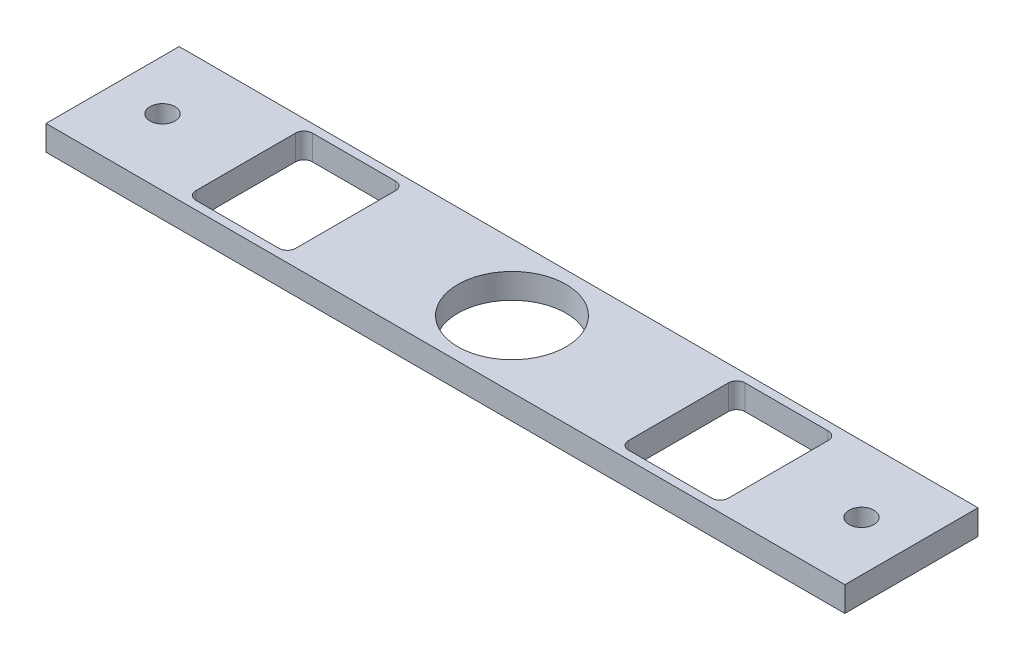
ISO-10303-21;
HEADER;
FILE_DESCRIPTION(('STEP AP214'),'2;1');
FILE_NAME('part.step','',(''),(''),'','','');
FILE_SCHEMA(('AUTOMOTIVE_DESIGN { 1 0 10303 214 1 1 1 1 }'));
ENDSEC;
DATA;
#1=APPLICATION_CONTEXT('core data for automotive mechanical design processes');
#2=APPLICATION_PROTOCOL_DEFINITION('international standard','automotive_design',2000,#1);
#3=PRODUCT_CONTEXT('',#1,'mechanical');
#4=PRODUCT('Part','Part','',(#3));
#5=PRODUCT_RELATED_PRODUCT_CATEGORY('part','',(#4));
#6=PRODUCT_DEFINITION_FORMATION('','',#4);
#7=PRODUCT_DEFINITION_CONTEXT('part definition',#1,'design');
#8=PRODUCT_DEFINITION('design','',#6,#7);
#9=PRODUCT_DEFINITION_SHAPE('','',#8);
#10=(LENGTH_UNIT() NAMED_UNIT(*) SI_UNIT(.MILLI.,.METRE.));
#11=(NAMED_UNIT(*) PLANE_ANGLE_UNIT() SI_UNIT($,.RADIAN.));
#12=(NAMED_UNIT(*) SI_UNIT($,.STERADIAN.) SOLID_ANGLE_UNIT());
#13=UNCERTAINTY_MEASURE_WITH_UNIT(LENGTH_MEASURE(1.E-05),#10,'distance_accuracy_value','');
#14=(GEOMETRIC_REPRESENTATION_CONTEXT(3) GLOBAL_UNCERTAINTY_ASSIGNED_CONTEXT((#13)) GLOBAL_UNIT_ASSIGNED_CONTEXT((#10,
#11,#12)) REPRESENTATION_CONTEXT('',''));
#15=CARTESIAN_POINT('',(0.,0.,0.));
#16=DIRECTION('',(0.,0.,1.));
#17=DIRECTION('',(1.,0.,0.));
#18=AXIS2_PLACEMENT_3D('',#15,#16,#17);
#19=CARTESIAN_POINT('',(152.4,9.525,-25.4));
#20=DIRECTION('',(-1.,0.,0.));
#21=DIRECTION('',(0.,0.,1.));
#22=AXIS2_PLACEMENT_3D('',#19,#20,#21);
#23=PLANE('',#22);
#24=DIRECTION('',(0.,0.,-1.));
#25=VECTOR('',#24,1.);
#26=CARTESIAN_POINT('',(152.4,0.,-25.4));
#27=LINE('',#26,#25);
#28=CARTESIAN_POINT('',(152.4,0.,25.4));
#29=VERTEX_POINT('',#28);
#30=CARTESIAN_POINT('',(152.4,0.,-25.4));
#31=VERTEX_POINT('',#30);
#32=EDGE_CURVE('E202',#29,#31,#27,.T.);
#33=ORIENTED_EDGE('',*,*,#32,.T.);
#34=DIRECTION('',(0.,-1.,0.));
#35=VECTOR('',#34,1.);
#36=CARTESIAN_POINT('',(152.4,9.525,-25.4));
#37=LINE('',#36,#35);
#38=CARTESIAN_POINT('',(152.4,9.525,-25.4));
#39=VERTEX_POINT('',#38);
#40=EDGE_CURVE('E183',#39,#31,#37,.T.);
#41=ORIENTED_EDGE('',*,*,#40,.F.);
#42=DIRECTION('',(0.,0.,-1.));
#43=VECTOR('',#42,1.);
#44=CARTESIAN_POINT('',(152.4,9.525,-25.4));
#45=LINE('',#44,#43);
#46=CARTESIAN_POINT('',(152.4,9.525,25.4));
#47=VERTEX_POINT('',#46);
#48=EDGE_CURVE('E190',#47,#39,#45,.T.);
#49=ORIENTED_EDGE('',*,*,#48,.F.);
#50=DIRECTION('',(0.,-1.,0.));
#51=VECTOR('',#50,1.);
#52=CARTESIAN_POINT('',(152.4,9.525,25.4));
#53=LINE('',#52,#51);
#54=EDGE_CURVE('E327',#47,#29,#53,.T.);
#55=ORIENTED_EDGE('',*,*,#54,.T.);
#56=EDGE_LOOP('',(#33,#41,#49,#55));
#57=FACE_BOUND('',#56,.T.);
#58=ADVANCED_FACE('F41',(#57),#23,.F.);
#59=CARTESIAN_POINT('',(-152.4,9.525,-25.4));
#60=DIRECTION('',(0.,0.,1.));
#61=DIRECTION('',(1.,0.,0.));
#62=AXIS2_PLACEMENT_3D('',#59,#60,#61);
#63=PLANE('',#62);
#64=DIRECTION('',(-1.,0.,0.));
#65=VECTOR('',#64,1.);
#66=CARTESIAN_POINT('',(-152.4,0.,-25.4));
#67=LINE('',#66,#65);
#68=CARTESIAN_POINT('',(-152.4,0.,-25.4));
#69=VERTEX_POINT('',#68);
#70=EDGE_CURVE('E329',#31,#69,#67,.T.);
#71=ORIENTED_EDGE('',*,*,#70,.T.);
#72=DIRECTION('',(0.,-1.,0.));
#73=VECTOR('',#72,1.);
#74=CARTESIAN_POINT('',(-152.4,9.525,-25.4));
#75=LINE('',#74,#73);
#76=CARTESIAN_POINT('',(-152.4,9.525,-25.4));
#77=VERTEX_POINT('',#76);
#78=EDGE_CURVE('E186',#77,#69,#75,.T.);
#79=ORIENTED_EDGE('',*,*,#78,.F.);
#80=DIRECTION('',(-1.,0.,0.));
#81=VECTOR('',#80,1.);
#82=CARTESIAN_POINT('',(-152.4,9.525,-25.4));
#83=LINE('',#82,#81);
#84=EDGE_CURVE('E179',#39,#77,#83,.T.);
#85=ORIENTED_EDGE('',*,*,#84,.F.);
#86=ORIENTED_EDGE('',*,*,#40,.T.);
#87=EDGE_LOOP('',(#71,#79,#85,#86));
#88=FACE_BOUND('',#87,.T.);
#89=ADVANCED_FACE('F181',(#88),#63,.F.);
#90=CARTESIAN_POINT('',(-152.4,9.525,-25.4));
#91=DIRECTION('',(1.,0.,0.));
#92=DIRECTION('',(0.,0.,-1.));
#93=AXIS2_PLACEMENT_3D('',#90,#91,#92);
#94=PLANE('',#93);
#95=DIRECTION('',(0.,0.,1.));
#96=VECTOR('',#95,1.);
#97=CARTESIAN_POINT('',(-152.4,0.,-25.4));
#98=LINE('',#97,#96);
#99=CARTESIAN_POINT('',(-152.4,0.,25.4));
#100=VERTEX_POINT('',#99);
#101=EDGE_CURVE('E331',#69,#100,#98,.T.);
#102=ORIENTED_EDGE('',*,*,#101,.T.);
#103=DIRECTION('',(0.,-1.,0.));
#104=VECTOR('',#103,1.);
#105=CARTESIAN_POINT('',(-152.4,9.525,25.4));
#106=LINE('',#105,#104);
#107=CARTESIAN_POINT('',(-152.4,9.525,25.4));
#108=VERTEX_POINT('',#107);
#109=EDGE_CURVE('E207',#108,#100,#106,.T.);
#110=ORIENTED_EDGE('',*,*,#109,.F.);
#111=DIRECTION('',(0.,0.,1.));
#112=VECTOR('',#111,1.);
#113=CARTESIAN_POINT('',(-152.4,9.525,-25.4));
#114=LINE('',#113,#112);
#115=EDGE_CURVE('E189',#77,#108,#114,.T.);
#116=ORIENTED_EDGE('',*,*,#115,.F.);
#117=ORIENTED_EDGE('',*,*,#78,.T.);
#118=EDGE_LOOP('',(#102,#110,#116,#117));
#119=FACE_BOUND('',#118,.T.);
#120=ADVANCED_FACE('F342',(#119),#94,.F.);
#121=CARTESIAN_POINT('',(-152.4,9.525,25.4));
#122=DIRECTION('',(0.,0.,-1.));
#123=DIRECTION('',(-1.,0.,0.));
#124=AXIS2_PLACEMENT_3D('',#121,#122,#123);
#125=PLANE('',#124);
#126=DIRECTION('',(1.,0.,0.));
#127=VECTOR('',#126,1.);
#128=CARTESIAN_POINT('',(-152.4,0.,25.4));
#129=LINE('',#128,#127);
#130=EDGE_CURVE('E199',#100,#29,#129,.T.);
#131=ORIENTED_EDGE('',*,*,#130,.T.);
#132=ORIENTED_EDGE('',*,*,#54,.F.);
#133=DIRECTION('',(1.,0.,0.));
#134=VECTOR('',#133,1.);
#135=CARTESIAN_POINT('',(-152.4,9.525,25.4));
#136=LINE('',#135,#134);
#137=EDGE_CURVE('E195',#108,#47,#136,.T.);
#138=ORIENTED_EDGE('',*,*,#137,.F.);
#139=ORIENTED_EDGE('',*,*,#109,.T.);
#140=EDGE_LOOP('',(#131,#132,#138,#139));
#141=FACE_BOUND('',#140,.T.);
#142=ADVANCED_FACE('F338',(#141),#125,.F.);
#143=CARTESIAN_POINT('',(0.,9.525,0.));
#144=DIRECTION('',(0.,1.,0.));
#145=DIRECTION('',(0.,0.,1.));
#146=AXIS2_PLACEMENT_3D('',#143,#144,#145);
#147=PLANE('',#146);
#148=CARTESIAN_POINT('',(-133.35,9.525,0.));
#149=DIRECTION('',(0.,1.,0.));
#150=DIRECTION('',(0.,0.,1.));
#151=AXIS2_PLACEMENT_3D('',#148,#149,#150);
#152=CIRCLE('',#151,4.76250000000001);
#153=CARTESIAN_POINT('',(-133.35,9.525,4.76250000000001));
#154=VERTEX_POINT('',#153);
#155=EDGE_CURVE('E423',#154,#154,#152,.T.);
#156=ORIENTED_EDGE('',*,*,#155,.F.);
#157=EDGE_LOOP('',(#156));
#158=FACE_BOUND('',#157,.T.);
#159=DIRECTION('',(0.,0.,-1.));
#160=VECTOR('',#159,1.);
#161=CARTESIAN_POINT('',(101.6,9.525,-22.225));
#162=LINE('',#161,#160);
#163=CARTESIAN_POINT('',(101.6,9.525,19.05));
#164=VERTEX_POINT('',#163);
#165=CARTESIAN_POINT('',(101.6,9.525,-19.05));
#166=VERTEX_POINT('',#165);
#167=EDGE_CURVE('E409',#164,#166,#162,.T.);
#168=ORIENTED_EDGE('',*,*,#167,.F.);
#169=CARTESIAN_POINT('',(98.425,9.525,19.05));
#170=DIRECTION('',(0.,1.,0.));
#171=DIRECTION('',(0.,0.,1.));
#172=AXIS2_PLACEMENT_3D('',#169,#170,#171);
#173=CIRCLE('',#172,3.175);
#174=CARTESIAN_POINT('',(98.425,9.525,22.225));
#175=VERTEX_POINT('',#174);
#176=EDGE_CURVE('E251',#164,#175,#173,.F.);
#177=ORIENTED_EDGE('',*,*,#176,.T.);
#178=DIRECTION('',(1.,0.,0.));
#179=VECTOR('',#178,1.);
#180=CARTESIAN_POINT('',(63.5,9.525,22.225));
#181=LINE('',#180,#179);
#182=CARTESIAN_POINT('',(66.675,9.525,22.225));
#183=VERTEX_POINT('',#182);
#184=EDGE_CURVE('E399',#183,#175,#181,.T.);
#185=ORIENTED_EDGE('',*,*,#184,.F.);
#186=CARTESIAN_POINT('',(66.675,9.525,19.05));
#187=DIRECTION('',(0.,1.,0.));
#188=DIRECTION('',(0.,0.,1.));
#189=AXIS2_PLACEMENT_3D('',#186,#187,#188);
#190=CIRCLE('',#189,3.175);
#191=CARTESIAN_POINT('',(63.5,9.525,19.05));
#192=VERTEX_POINT('',#191);
#193=EDGE_CURVE('E259',#183,#192,#190,.F.);
#194=ORIENTED_EDGE('',*,*,#193,.T.);
#195=DIRECTION('',(0.,0.,1.));
#196=VECTOR('',#195,1.);
#197=CARTESIAN_POINT('',(63.5,9.525,-22.225));
#198=LINE('',#197,#196);
#199=CARTESIAN_POINT('',(63.5,9.525,-19.05));
#200=VERTEX_POINT('',#199);
#201=EDGE_CURVE('E403',#200,#192,#198,.T.);
#202=ORIENTED_EDGE('',*,*,#201,.F.);
#203=CARTESIAN_POINT('',(66.675,9.525,-19.05));
#204=DIRECTION('',(0.,1.,0.));
#205=DIRECTION('',(0.,0.,1.));
#206=AXIS2_PLACEMENT_3D('',#203,#204,#205);
#207=CIRCLE('',#206,3.175);
#208=CARTESIAN_POINT('',(66.675,9.525,-22.225));
#209=VERTEX_POINT('',#208);
#210=EDGE_CURVE('E247',#200,#209,#207,.F.);
#211=ORIENTED_EDGE('',*,*,#210,.T.);
#212=DIRECTION('',(-1.,0.,0.));
#213=VECTOR('',#212,1.);
#214=CARTESIAN_POINT('',(63.5,9.525,-22.225));
#215=LINE('',#214,#213);
#216=CARTESIAN_POINT('',(98.425,9.525,-22.225));
#217=VERTEX_POINT('',#216);
#218=EDGE_CURVE('E406',#217,#209,#215,.T.);
#219=ORIENTED_EDGE('',*,*,#218,.F.);
#220=CARTESIAN_POINT('',(98.425,9.525,-19.05));
#221=DIRECTION('',(0.,1.,0.));
#222=DIRECTION('',(0.,0.,1.));
#223=AXIS2_PLACEMENT_3D('',#220,#221,#222);
#224=CIRCLE('',#223,3.175);
#225=EDGE_CURVE('E255',#217,#166,#224,.F.);
#226=ORIENTED_EDGE('',*,*,#225,.T.);
#227=EDGE_LOOP('',(#168,#177,#185,#194,#202,#211,#219,#226));
#228=FACE_BOUND('',#227,.T.);
#229=DIRECTION('',(0.,0.,-1.));
#230=VECTOR('',#229,1.);
#231=CARTESIAN_POINT('',(-63.5,9.525,-22.225));
#232=LINE('',#231,#230);
#233=CARTESIAN_POINT('',(-63.5,9.525,19.05));
#234=VERTEX_POINT('',#233);
#235=CARTESIAN_POINT('',(-63.5,9.525,-19.05));
#236=VERTEX_POINT('',#235);
#237=EDGE_CURVE('E285',#234,#236,#232,.T.);
#238=ORIENTED_EDGE('',*,*,#237,.F.);
#239=CARTESIAN_POINT('',(-66.675,9.525,19.0500000000001));
#240=DIRECTION('',(0.,1.,0.));
#241=DIRECTION('',(0.,0.,1.));
#242=AXIS2_PLACEMENT_3D('',#239,#240,#241);
#243=CIRCLE('',#242,3.175);
#244=CARTESIAN_POINT('',(-66.675,9.525,22.2250000000001));
#245=VERTEX_POINT('',#244);
#246=EDGE_CURVE('E267',#234,#245,#243,.F.);
#247=ORIENTED_EDGE('',*,*,#246,.T.);
#248=DIRECTION('',(1.,0.,0.));
#249=VECTOR('',#248,1.);
#250=CARTESIAN_POINT('',(-101.6,9.525,22.2250000000001));
#251=LINE('',#250,#249);
#252=CARTESIAN_POINT('',(-98.425,9.525,22.2250000000001));
#253=VERTEX_POINT('',#252);
#254=EDGE_CURVE('E311',#253,#245,#251,.T.);
#255=ORIENTED_EDGE('',*,*,#254,.F.);
#256=CARTESIAN_POINT('',(-98.425,9.525,19.0500000000001));
#257=DIRECTION('',(0.,1.,0.));
#258=DIRECTION('',(0.,0.,1.));
#259=AXIS2_PLACEMENT_3D('',#256,#257,#258);
#260=CIRCLE('',#259,3.175);
#261=CARTESIAN_POINT('',(-101.6,9.525,19.05));
#262=VERTEX_POINT('',#261);
#263=EDGE_CURVE('E263',#253,#262,#260,.F.);
#264=ORIENTED_EDGE('',*,*,#263,.T.);
#265=DIRECTION('',(0.,0.,1.));
#266=VECTOR('',#265,1.);
#267=CARTESIAN_POINT('',(-101.6,9.525,-22.225));
#268=LINE('',#267,#266);
#269=CARTESIAN_POINT('',(-101.6,9.525,-19.05));
#270=VERTEX_POINT('',#269);
#271=EDGE_CURVE('E280',#270,#262,#268,.T.);
#272=ORIENTED_EDGE('',*,*,#271,.F.);
#273=CARTESIAN_POINT('',(-98.425,9.525,-19.05));
#274=DIRECTION('',(0.,1.,0.));
#275=DIRECTION('',(0.,0.,1.));
#276=AXIS2_PLACEMENT_3D('',#273,#274,#275);
#277=CIRCLE('',#276,3.175);
#278=CARTESIAN_POINT('',(-98.425,9.525,-22.225));
#279=VERTEX_POINT('',#278);
#280=EDGE_CURVE('E49',#270,#279,#277,.F.);
#281=ORIENTED_EDGE('',*,*,#280,.T.);
#282=DIRECTION('',(-1.,0.,0.));
#283=VECTOR('',#282,1.);
#284=CARTESIAN_POINT('',(-101.6,9.525,-22.225));
#285=LINE('',#284,#283);
#286=CARTESIAN_POINT('',(-66.675,9.525,-22.225));
#287=VERTEX_POINT('',#286);
#288=EDGE_CURVE('E278',#287,#279,#285,.T.);
#289=ORIENTED_EDGE('',*,*,#288,.F.);
#290=CARTESIAN_POINT('',(-66.675,9.525,-19.05));
#291=DIRECTION('',(0.,1.,0.));
#292=DIRECTION('',(0.,0.,1.));
#293=AXIS2_PLACEMENT_3D('',#290,#291,#292);
#294=CIRCLE('',#293,3.175);
#295=EDGE_CURVE('E271',#287,#236,#294,.F.);
#296=ORIENTED_EDGE('',*,*,#295,.T.);
#297=EDGE_LOOP('',(#238,#247,#255,#264,#272,#281,#289,#296));
#298=FACE_BOUND('',#297,.T.);
#299=CARTESIAN_POINT('',(133.35,9.525,0.));
#300=DIRECTION('',(0.,1.,0.));
#301=DIRECTION('',(0.,0.,1.));
#302=AXIS2_PLACEMENT_3D('',#299,#300,#301);
#303=CIRCLE('',#302,4.76250000000001);
#304=CARTESIAN_POINT('',(133.35,9.525,4.76250000000001));
#305=VERTEX_POINT('',#304);
#306=EDGE_CURVE('E301',#305,#305,#303,.T.);
#307=ORIENTED_EDGE('',*,*,#306,.F.);
#308=EDGE_LOOP('',(#307));
#309=FACE_BOUND('',#308,.T.);
#310=CARTESIAN_POINT('',(0.,9.525,0.));
#311=DIRECTION('',(0.,1.,0.));
#312=DIRECTION('',(0.,0.,1.));
#313=AXIS2_PLACEMENT_3D('',#310,#311,#312);
#314=CIRCLE('',#313,20.6375);
#315=CARTESIAN_POINT('',(0.,9.525,20.6375));
#316=VERTEX_POINT('',#315);
#317=EDGE_CURVE('E317',#316,#316,#314,.T.);
#318=ORIENTED_EDGE('',*,*,#317,.F.);
#319=EDGE_LOOP('',(#318));
#320=FACE_BOUND('',#319,.T.);
#321=ORIENTED_EDGE('',*,*,#48,.T.);
#322=ORIENTED_EDGE('',*,*,#84,.T.);
#323=ORIENTED_EDGE('',*,*,#115,.T.);
#324=ORIENTED_EDGE('',*,*,#137,.T.);
#325=EDGE_LOOP('',(#321,#322,#323,#324));
#326=FACE_BOUND('',#325,.T.);
#327=ADVANCED_FACE('F193',(#158,#228,#298,#309,#320,#326),#147,.T.);
#328=CARTESIAN_POINT('',(0.,0.,0.));
#329=DIRECTION('',(0.,1.,0.));
#330=DIRECTION('',(0.,0.,1.));
#331=AXIS2_PLACEMENT_3D('',#328,#329,#330);
#332=PLANE('',#331);
#333=CARTESIAN_POINT('',(-133.35,0.,0.));
#334=DIRECTION('',(0.,1.,0.));
#335=DIRECTION('',(0.,0.,1.));
#336=AXIS2_PLACEMENT_3D('',#333,#334,#335);
#337=CIRCLE('',#336,4.76250000000001);
#338=CARTESIAN_POINT('',(-133.35,0.,4.76250000000001));
#339=VERTEX_POINT('',#338);
#340=EDGE_CURVE('E412',#339,#339,#337,.T.);
#341=ORIENTED_EDGE('',*,*,#340,.T.);
#342=EDGE_LOOP('',(#341));
#343=FACE_BOUND('',#342,.T.);
#344=DIRECTION('',(0.,0.,1.));
#345=VECTOR('',#344,1.);
#346=CARTESIAN_POINT('',(63.5,0.,-22.225));
#347=LINE('',#346,#345);
#348=CARTESIAN_POINT('',(63.5,0.,-19.05));
#349=VERTEX_POINT('',#348);
#350=CARTESIAN_POINT('',(63.5,0.,19.05));
#351=VERTEX_POINT('',#350);
#352=EDGE_CURVE('E415',#349,#351,#347,.T.);
#353=ORIENTED_EDGE('',*,*,#352,.T.);
#354=CARTESIAN_POINT('',(66.675,0.,19.05));
#355=DIRECTION('',(0.,1.,0.));
#356=DIRECTION('',(0.,0.,1.));
#357=AXIS2_PLACEMENT_3D('',#354,#355,#356);
#358=CIRCLE('',#357,3.175);
#359=CARTESIAN_POINT('',(66.675,0.,22.225));
#360=VERTEX_POINT('',#359);
#361=EDGE_CURVE('E261',#351,#360,#358,.T.);
#362=ORIENTED_EDGE('',*,*,#361,.T.);
#363=DIRECTION('',(1.,0.,0.));
#364=VECTOR('',#363,1.);
#365=CARTESIAN_POINT('',(63.5,0.,22.225));
#366=LINE('',#365,#364);
#367=CARTESIAN_POINT('',(98.425,0.,22.225));
#368=VERTEX_POINT('',#367);
#369=EDGE_CURVE('E308',#360,#368,#366,.T.);
#370=ORIENTED_EDGE('',*,*,#369,.T.);
#371=CARTESIAN_POINT('',(98.425,0.,19.05));
#372=DIRECTION('',(0.,1.,0.));
#373=DIRECTION('',(0.,0.,1.));
#374=AXIS2_PLACEMENT_3D('',#371,#372,#373);
#375=CIRCLE('',#374,3.175);
#376=CARTESIAN_POINT('',(101.6,0.,19.05));
#377=VERTEX_POINT('',#376);
#378=EDGE_CURVE('E253',#368,#377,#375,.T.);
#379=ORIENTED_EDGE('',*,*,#378,.T.);
#380=DIRECTION('',(0.,0.,-1.));
#381=VECTOR('',#380,1.);
#382=CARTESIAN_POINT('',(101.6,0.,-22.225));
#383=LINE('',#382,#381);
#384=CARTESIAN_POINT('',(101.6,0.,-19.05));
#385=VERTEX_POINT('',#384);
#386=EDGE_CURVE('E402',#377,#385,#383,.T.);
#387=ORIENTED_EDGE('',*,*,#386,.T.);
#388=CARTESIAN_POINT('',(98.425,0.,-19.05));
#389=DIRECTION('',(0.,1.,0.));
#390=DIRECTION('',(0.,0.,1.));
#391=AXIS2_PLACEMENT_3D('',#388,#389,#390);
#392=CIRCLE('',#391,3.175);
#393=CARTESIAN_POINT('',(98.425,0.,-22.225));
#394=VERTEX_POINT('',#393);
#395=EDGE_CURVE('E257',#385,#394,#392,.T.);
#396=ORIENTED_EDGE('',*,*,#395,.T.);
#397=DIRECTION('',(-1.,0.,0.));
#398=VECTOR('',#397,1.);
#399=CARTESIAN_POINT('',(63.5,0.,-22.225));
#400=LINE('',#399,#398);
#401=CARTESIAN_POINT('',(66.675,0.,-22.225));
#402=VERTEX_POINT('',#401);
#403=EDGE_CURVE('E418',#394,#402,#400,.T.);
#404=ORIENTED_EDGE('',*,*,#403,.T.);
#405=CARTESIAN_POINT('',(66.675,0.,-19.05));
#406=DIRECTION('',(0.,1.,0.));
#407=DIRECTION('',(0.,0.,1.));
#408=AXIS2_PLACEMENT_3D('',#405,#406,#407);
#409=CIRCLE('',#408,3.175);
#410=EDGE_CURVE('E249',#402,#349,#409,.T.);
#411=ORIENTED_EDGE('',*,*,#410,.T.);
#412=EDGE_LOOP('',(#353,#362,#370,#379,#387,#396,#404,#411));
#413=FACE_BOUND('',#412,.T.);
#414=DIRECTION('',(0.,0.,1.));
#415=VECTOR('',#414,1.);
#416=CARTESIAN_POINT('',(-101.6,0.,-22.225));
#417=LINE('',#416,#415);
#418=CARTESIAN_POINT('',(-101.6,0.,-19.05));
#419=VERTEX_POINT('',#418);
#420=CARTESIAN_POINT('',(-101.6,0.,19.05));
#421=VERTEX_POINT('',#420);
#422=EDGE_CURVE('E292',#419,#421,#417,.T.);
#423=ORIENTED_EDGE('',*,*,#422,.T.);
#424=CARTESIAN_POINT('',(-98.425,0.,19.0500000000001));
#425=DIRECTION('',(0.,1.,0.));
#426=DIRECTION('',(0.,0.,1.));
#427=AXIS2_PLACEMENT_3D('',#424,#425,#426);
#428=CIRCLE('',#427,3.175);
#429=CARTESIAN_POINT('',(-98.425,0.,22.2250000000001));
#430=VERTEX_POINT('',#429);
#431=EDGE_CURVE('E265',#421,#430,#428,.T.);
#432=ORIENTED_EDGE('',*,*,#431,.T.);
#433=DIRECTION('',(1.,0.,0.));
#434=VECTOR('',#433,1.);
#435=CARTESIAN_POINT('',(-101.6,0.,22.2250000000001));
#436=LINE('',#435,#434);
#437=CARTESIAN_POINT('',(-66.675,0.,22.2250000000001));
#438=VERTEX_POINT('',#437);
#439=EDGE_CURVE('E298',#430,#438,#436,.T.);
#440=ORIENTED_EDGE('',*,*,#439,.T.);
#441=CARTESIAN_POINT('',(-66.675,0.,19.0500000000001));
#442=DIRECTION('',(0.,1.,0.));
#443=DIRECTION('',(0.,0.,1.));
#444=AXIS2_PLACEMENT_3D('',#441,#442,#443);
#445=CIRCLE('',#444,3.175);
#446=CARTESIAN_POINT('',(-63.5,0.,19.05));
#447=VERTEX_POINT('',#446);
#448=EDGE_CURVE('E269',#438,#447,#445,.T.);
#449=ORIENTED_EDGE('',*,*,#448,.T.);
#450=DIRECTION('',(0.,0.,-1.));
#451=VECTOR('',#450,1.);
#452=CARTESIAN_POINT('',(-63.5,0.,-22.225));
#453=LINE('',#452,#451);
#454=CARTESIAN_POINT('',(-63.5,0.,-19.05));
#455=VERTEX_POINT('',#454);
#456=EDGE_CURVE('E303',#447,#455,#453,.T.);
#457=ORIENTED_EDGE('',*,*,#456,.T.);
#458=CARTESIAN_POINT('',(-66.675,0.,-19.05));
#459=DIRECTION('',(0.,1.,0.));
#460=DIRECTION('',(0.,0.,1.));
#461=AXIS2_PLACEMENT_3D('',#458,#459,#460);
#462=CIRCLE('',#461,3.175);
#463=CARTESIAN_POINT('',(-66.675,0.,-22.225));
#464=VERTEX_POINT('',#463);
#465=EDGE_CURVE('E63',#455,#464,#462,.T.);
#466=ORIENTED_EDGE('',*,*,#465,.T.);
#467=DIRECTION('',(-1.,0.,0.));
#468=VECTOR('',#467,1.);
#469=CARTESIAN_POINT('',(-101.6,0.,-22.225));
#470=LINE('',#469,#468);
#471=CARTESIAN_POINT('',(-98.425,0.,-22.225));
#472=VERTEX_POINT('',#471);
#473=EDGE_CURVE('E294',#464,#472,#470,.T.);
#474=ORIENTED_EDGE('',*,*,#473,.T.);
#475=CARTESIAN_POINT('',(-98.425,0.,-19.05));
#476=DIRECTION('',(0.,1.,0.));
#477=DIRECTION('',(0.,0.,1.));
#478=AXIS2_PLACEMENT_3D('',#475,#476,#477);
#479=CIRCLE('',#478,3.175);
#480=EDGE_CURVE('E11',#472,#419,#479,.T.);
#481=ORIENTED_EDGE('',*,*,#480,.T.);
#482=EDGE_LOOP('',(#423,#432,#440,#449,#457,#466,#474,#481));
#483=FACE_BOUND('',#482,.T.);
#484=CARTESIAN_POINT('',(133.35,0.,0.));
#485=DIRECTION('',(0.,1.,0.));
#486=DIRECTION('',(0.,0.,1.));
#487=AXIS2_PLACEMENT_3D('',#484,#485,#486);
#488=CIRCLE('',#487,4.76250000000001);
#489=CARTESIAN_POINT('',(133.35,0.,4.76250000000001));
#490=VERTEX_POINT('',#489);
#491=EDGE_CURVE('E314',#490,#490,#488,.T.);
#492=ORIENTED_EDGE('',*,*,#491,.T.);
#493=EDGE_LOOP('',(#492));
#494=FACE_BOUND('',#493,.T.);
#495=CARTESIAN_POINT('',(0.,0.,0.));
#496=DIRECTION('',(0.,1.,0.));
#497=DIRECTION('',(0.,0.,1.));
#498=AXIS2_PLACEMENT_3D('',#495,#496,#497);
#499=CIRCLE('',#498,20.6375);
#500=CARTESIAN_POINT('',(0.,0.,20.6375));
#501=VERTEX_POINT('',#500);
#502=EDGE_CURVE('E320',#501,#501,#499,.T.);
#503=ORIENTED_EDGE('',*,*,#502,.T.);
#504=EDGE_LOOP('',(#503));
#505=FACE_BOUND('',#504,.T.);
#506=ORIENTED_EDGE('',*,*,#32,.F.);
#507=ORIENTED_EDGE('',*,*,#130,.F.);
#508=ORIENTED_EDGE('',*,*,#101,.F.);
#509=ORIENTED_EDGE('',*,*,#70,.F.);
#510=EDGE_LOOP('',(#506,#507,#508,#509));
#511=FACE_BOUND('',#510,.T.);
#512=ADVANCED_FACE('F290',(#343,#413,#483,#494,#505,#511),#332,.F.);
#513=CARTESIAN_POINT('',(0.,0.,0.));
#514=DIRECTION('',(0.,1.,0.));
#515=DIRECTION('',(0.,0.,1.));
#516=AXIS2_PLACEMENT_3D('',#513,#514,#515);
#517=CYLINDRICAL_SURFACE('',#516,20.6375);
#518=ORIENTED_EDGE('',*,*,#502,.F.);
#519=EDGE_LOOP('',(#518));
#520=FACE_BOUND('',#519,.T.);
#521=ORIENTED_EDGE('',*,*,#317,.T.);
#522=EDGE_LOOP('',(#521));
#523=FACE_BOUND('',#522,.T.);
#524=ADVANCED_FACE('F489',(#520,#523),#517,.F.);
#525=CARTESIAN_POINT('',(133.35,0.,0.));
#526=DIRECTION('',(0.,1.,0.));
#527=DIRECTION('',(0.,0.,1.));
#528=AXIS2_PLACEMENT_3D('',#525,#526,#527);
#529=CYLINDRICAL_SURFACE('',#528,4.76250000000001);
#530=ORIENTED_EDGE('',*,*,#491,.F.);
#531=EDGE_LOOP('',(#530));
#532=FACE_BOUND('',#531,.T.);
#533=ORIENTED_EDGE('',*,*,#306,.T.);
#534=EDGE_LOOP('',(#533));
#535=FACE_BOUND('',#534,.T.);
#536=ADVANCED_FACE('F486',(#532,#535),#529,.F.);
#537=CARTESIAN_POINT('',(-63.5,0.,-22.225));
#538=DIRECTION('',(1.,0.,0.));
#539=DIRECTION('',(0.,0.,-1.));
#540=AXIS2_PLACEMENT_3D('',#537,#538,#539);
#541=PLANE('',#540);
#542=ORIENTED_EDGE('',*,*,#456,.F.);
#543=DIRECTION('',(0.,1.,0.));
#544=VECTOR('',#543,1.);
#545=CARTESIAN_POINT('',(-63.5,9.525,19.0500000000001));
#546=LINE('',#545,#544);
#547=EDGE_CURVE('E240',#447,#234,#546,.T.);
#548=ORIENTED_EDGE('',*,*,#547,.T.);
#549=ORIENTED_EDGE('',*,*,#237,.T.);
#550=DIRECTION('',(0.,1.,0.));
#551=VECTOR('',#550,1.);
#552=CARTESIAN_POINT('',(-63.5,0.,-19.05));
#553=LINE('',#552,#551);
#554=EDGE_CURVE('E238',#236,#455,#553,.F.);
#555=ORIENTED_EDGE('',*,*,#554,.T.);
#556=EDGE_LOOP('',(#542,#548,#549,#555));
#557=FACE_BOUND('',#556,.T.);
#558=ADVANCED_FACE('F389',(#557),#541,.F.);
#559=CARTESIAN_POINT('',(-101.6,0.,22.2250000000001));
#560=DIRECTION('',(0.,0.,1.));
#561=DIRECTION('',(1.,0.,0.));
#562=AXIS2_PLACEMENT_3D('',#559,#560,#561);
#563=PLANE('',#562);
#564=ORIENTED_EDGE('',*,*,#439,.F.);
#565=DIRECTION('',(0.,1.,0.));
#566=VECTOR('',#565,1.);
#567=CARTESIAN_POINT('',(-98.425,9.525,22.2250000000001));
#568=LINE('',#567,#566);
#569=EDGE_CURVE('E230',#430,#253,#568,.T.);
#570=ORIENTED_EDGE('',*,*,#569,.T.);
#571=ORIENTED_EDGE('',*,*,#254,.T.);
#572=DIRECTION('',(0.,1.,0.));
#573=VECTOR('',#572,1.);
#574=CARTESIAN_POINT('',(-66.675,0.,22.2250000000001));
#575=LINE('',#574,#573);
#576=EDGE_CURVE('E228',#245,#438,#575,.F.);
#577=ORIENTED_EDGE('',*,*,#576,.T.);
#578=EDGE_LOOP('',(#564,#570,#571,#577));
#579=FACE_BOUND('',#578,.T.);
#580=ADVANCED_FACE('F396',(#579),#563,.F.);
#581=CARTESIAN_POINT('',(-101.6,0.,-22.225));
#582=DIRECTION('',(-1.,0.,0.));
#583=DIRECTION('',(0.,0.,1.));
#584=AXIS2_PLACEMENT_3D('',#581,#582,#583);
#585=PLANE('',#584);
#586=ORIENTED_EDGE('',*,*,#271,.T.);
#587=DIRECTION('',(0.,1.,0.));
#588=VECTOR('',#587,1.);
#589=CARTESIAN_POINT('',(-101.6,0.,19.0500000000001));
#590=LINE('',#589,#588);
#591=EDGE_CURVE('E236',#262,#421,#590,.F.);
#592=ORIENTED_EDGE('',*,*,#591,.T.);
#593=ORIENTED_EDGE('',*,*,#422,.F.);
#594=DIRECTION('',(0.,1.,0.));
#595=VECTOR('',#594,1.);
#596=CARTESIAN_POINT('',(-101.6,9.525,-19.05));
#597=LINE('',#596,#595);
#598=EDGE_CURVE('E233',#419,#270,#597,.T.);
#599=ORIENTED_EDGE('',*,*,#598,.T.);
#600=EDGE_LOOP('',(#586,#592,#593,#599));
#601=FACE_BOUND('',#600,.T.);
#602=ADVANCED_FACE('F296',(#601),#585,.F.);
#603=CARTESIAN_POINT('',(-101.6,0.,-22.225));
#604=DIRECTION('',(0.,0.,-1.));
#605=DIRECTION('',(-1.,0.,0.));
#606=AXIS2_PLACEMENT_3D('',#603,#604,#605);
#607=PLANE('',#606);
#608=ORIENTED_EDGE('',*,*,#473,.F.);
#609=DIRECTION('',(0.,1.,0.));
#610=VECTOR('',#609,1.);
#611=CARTESIAN_POINT('',(-66.675,9.525,-22.225));
#612=LINE('',#611,#610);
#613=EDGE_CURVE('E244',#464,#287,#612,.T.);
#614=ORIENTED_EDGE('',*,*,#613,.T.);
#615=ORIENTED_EDGE('',*,*,#288,.T.);
#616=DIRECTION('',(0.,1.,0.));
#617=VECTOR('',#616,1.);
#618=CARTESIAN_POINT('',(-98.425,0.,-22.225));
#619=LINE('',#618,#617);
#620=EDGE_CURVE('E56',#279,#472,#619,.F.);
#621=ORIENTED_EDGE('',*,*,#620,.T.);
#622=EDGE_LOOP('',(#608,#614,#615,#621));
#623=FACE_BOUND('',#622,.T.);
#624=ADVANCED_FACE('F283',(#623),#607,.F.);
#625=CARTESIAN_POINT('',(101.6,0.,-22.225));
#626=DIRECTION('',(1.,0.,0.));
#627=DIRECTION('',(0.,0.,-1.));
#628=AXIS2_PLACEMENT_3D('',#625,#626,#627);
#629=PLANE('',#628);
#630=ORIENTED_EDGE('',*,*,#386,.F.);
#631=DIRECTION('',(0.,1.,0.));
#632=VECTOR('',#631,1.);
#633=CARTESIAN_POINT('',(101.6,9.525,19.05));
#634=LINE('',#633,#632);
#635=EDGE_CURVE('E220',#377,#164,#634,.T.);
#636=ORIENTED_EDGE('',*,*,#635,.T.);
#637=ORIENTED_EDGE('',*,*,#167,.T.);
#638=DIRECTION('',(0.,1.,0.));
#639=VECTOR('',#638,1.);
#640=CARTESIAN_POINT('',(101.6,0.,-19.05));
#641=LINE('',#640,#639);
#642=EDGE_CURVE('E218',#166,#385,#641,.F.);
#643=ORIENTED_EDGE('',*,*,#642,.T.);
#644=EDGE_LOOP('',(#630,#636,#637,#643));
#645=FACE_BOUND('',#644,.T.);
#646=ADVANCED_FACE('F446',(#645),#629,.F.);
#647=CARTESIAN_POINT('',(63.5,0.,22.225));
#648=DIRECTION('',(0.,0.,1.));
#649=DIRECTION('',(1.,0.,0.));
#650=AXIS2_PLACEMENT_3D('',#647,#648,#649);
#651=PLANE('',#650);
#652=ORIENTED_EDGE('',*,*,#184,.T.);
#653=DIRECTION('',(0.,1.,0.));
#654=VECTOR('',#653,1.);
#655=CARTESIAN_POINT('',(98.425,0.,22.225));
#656=LINE('',#655,#654);
#657=EDGE_CURVE('E226',#175,#368,#656,.F.);
#658=ORIENTED_EDGE('',*,*,#657,.T.);
#659=ORIENTED_EDGE('',*,*,#369,.F.);
#660=DIRECTION('',(0.,1.,0.));
#661=VECTOR('',#660,1.);
#662=CARTESIAN_POINT('',(66.675,9.525,22.225));
#663=LINE('',#662,#661);
#664=EDGE_CURVE('E223',#360,#183,#663,.T.);
#665=ORIENTED_EDGE('',*,*,#664,.T.);
#666=EDGE_LOOP('',(#652,#658,#659,#665));
#667=FACE_BOUND('',#666,.T.);
#668=ADVANCED_FACE('F465',(#667),#651,.F.);
#669=CARTESIAN_POINT('',(63.5,0.,-22.225));
#670=DIRECTION('',(-1.,0.,0.));
#671=DIRECTION('',(0.,0.,1.));
#672=AXIS2_PLACEMENT_3D('',#669,#670,#671);
#673=PLANE('',#672);
#674=ORIENTED_EDGE('',*,*,#352,.F.);
#675=DIRECTION('',(0.,1.,0.));
#676=VECTOR('',#675,1.);
#677=CARTESIAN_POINT('',(63.5,9.525,-19.05));
#678=LINE('',#677,#676);
#679=EDGE_CURVE('E205',#349,#200,#678,.T.);
#680=ORIENTED_EDGE('',*,*,#679,.T.);
#681=ORIENTED_EDGE('',*,*,#201,.T.);
#682=DIRECTION('',(0.,1.,0.));
#683=VECTOR('',#682,1.);
#684=CARTESIAN_POINT('',(63.5,0.,19.05));
#685=LINE('',#684,#683);
#686=EDGE_CURVE('E203',#192,#351,#685,.F.);
#687=ORIENTED_EDGE('',*,*,#686,.T.);
#688=EDGE_LOOP('',(#674,#680,#681,#687));
#689=FACE_BOUND('',#688,.T.);
#690=ADVANCED_FACE('F458',(#689),#673,.F.);
#691=CARTESIAN_POINT('',(63.5,0.,-22.225));
#692=DIRECTION('',(0.,0.,-1.));
#693=DIRECTION('',(-1.,0.,0.));
#694=AXIS2_PLACEMENT_3D('',#691,#692,#693);
#695=PLANE('',#694);
#696=ORIENTED_EDGE('',*,*,#218,.T.);
#697=DIRECTION('',(0.,1.,0.));
#698=VECTOR('',#697,1.);
#699=CARTESIAN_POINT('',(66.675,0.,-22.225));
#700=LINE('',#699,#698);
#701=EDGE_CURVE('E216',#209,#402,#700,.F.);
#702=ORIENTED_EDGE('',*,*,#701,.T.);
#703=ORIENTED_EDGE('',*,*,#403,.F.);
#704=DIRECTION('',(0.,1.,0.));
#705=VECTOR('',#704,1.);
#706=CARTESIAN_POINT('',(98.425,9.525,-22.225));
#707=LINE('',#706,#705);
#708=EDGE_CURVE('E213',#394,#217,#707,.T.);
#709=ORIENTED_EDGE('',*,*,#708,.T.);
#710=EDGE_LOOP('',(#696,#702,#703,#709));
#711=FACE_BOUND('',#710,.T.);
#712=ADVANCED_FACE('F433',(#711),#695,.F.);
#713=CARTESIAN_POINT('',(-133.35,0.,0.));
#714=DIRECTION('',(0.,1.,0.));
#715=DIRECTION('',(0.,0.,1.));
#716=AXIS2_PLACEMENT_3D('',#713,#714,#715);
#717=CYLINDRICAL_SURFACE('',#716,4.76250000000001);
#718=ORIENTED_EDGE('',*,*,#340,.F.);
#719=EDGE_LOOP('',(#718));
#720=FACE_BOUND('',#719,.T.);
#721=ORIENTED_EDGE('',*,*,#155,.T.);
#722=EDGE_LOOP('',(#721));
#723=FACE_BOUND('',#722,.T.);
#724=ADVANCED_FACE('F360',(#720,#723),#717,.F.);
#725=CARTESIAN_POINT('',(66.675,0.,-19.05));
#726=DIRECTION('',(0.,-1.,0.));
#727=DIRECTION('',(0.,0.,-1.));
#728=AXIS2_PLACEMENT_3D('',#725,#726,#727);
#729=CYLINDRICAL_SURFACE('',#728,3.175);
#730=ORIENTED_EDGE('',*,*,#410,.F.);
#731=ORIENTED_EDGE('',*,*,#701,.F.);
#732=ORIENTED_EDGE('',*,*,#210,.F.);
#733=ORIENTED_EDGE('',*,*,#679,.F.);
#734=EDGE_LOOP('',(#730,#731,#732,#733));
#735=FACE_BOUND('',#734,.T.);
#736=ADVANCED_FACE('F356',(#735),#729,.F.);
#737=CARTESIAN_POINT('',(98.425,0.,19.05));
#738=DIRECTION('',(0.,-1.,0.));
#739=DIRECTION('',(0.,0.,-1.));
#740=AXIS2_PLACEMENT_3D('',#737,#738,#739);
#741=CYLINDRICAL_SURFACE('',#740,3.175);
#742=ORIENTED_EDGE('',*,*,#378,.F.);
#743=ORIENTED_EDGE('',*,*,#657,.F.);
#744=ORIENTED_EDGE('',*,*,#176,.F.);
#745=ORIENTED_EDGE('',*,*,#635,.F.);
#746=EDGE_LOOP('',(#742,#743,#744,#745));
#747=FACE_BOUND('',#746,.T.);
#748=ADVANCED_FACE('F359',(#747),#741,.F.);
#749=CARTESIAN_POINT('',(98.425,0.,-19.05));
#750=DIRECTION('',(0.,-1.,0.));
#751=DIRECTION('',(0.,0.,-1.));
#752=AXIS2_PLACEMENT_3D('',#749,#750,#751);
#753=CYLINDRICAL_SURFACE('',#752,3.175);
#754=ORIENTED_EDGE('',*,*,#395,.F.);
#755=ORIENTED_EDGE('',*,*,#642,.F.);
#756=ORIENTED_EDGE('',*,*,#225,.F.);
#757=ORIENTED_EDGE('',*,*,#708,.F.);
#758=EDGE_LOOP('',(#754,#755,#756,#757));
#759=FACE_BOUND('',#758,.T.);
#760=ADVANCED_FACE('F364',(#759),#753,.F.);
#761=CARTESIAN_POINT('',(66.675,0.,19.05));
#762=DIRECTION('',(0.,-1.,0.));
#763=DIRECTION('',(0.,0.,-1.));
#764=AXIS2_PLACEMENT_3D('',#761,#762,#763);
#765=CYLINDRICAL_SURFACE('',#764,3.175);
#766=ORIENTED_EDGE('',*,*,#361,.F.);
#767=ORIENTED_EDGE('',*,*,#686,.F.);
#768=ORIENTED_EDGE('',*,*,#193,.F.);
#769=ORIENTED_EDGE('',*,*,#664,.F.);
#770=EDGE_LOOP('',(#766,#767,#768,#769));
#771=FACE_BOUND('',#770,.T.);
#772=ADVANCED_FACE('F368',(#771),#765,.F.);
#773=CARTESIAN_POINT('',(-98.425,0.,19.0500000000001));
#774=DIRECTION('',(0.,-1.,0.));
#775=DIRECTION('',(0.,0.,-1.));
#776=AXIS2_PLACEMENT_3D('',#773,#774,#775);
#777=CYLINDRICAL_SURFACE('',#776,3.175);
#778=ORIENTED_EDGE('',*,*,#431,.F.);
#779=ORIENTED_EDGE('',*,*,#591,.F.);
#780=ORIENTED_EDGE('',*,*,#263,.F.);
#781=ORIENTED_EDGE('',*,*,#569,.F.);
#782=EDGE_LOOP('',(#778,#779,#780,#781));
#783=FACE_BOUND('',#782,.T.);
#784=ADVANCED_FACE('F372',(#783),#777,.F.);
#785=CARTESIAN_POINT('',(-66.675,0.,19.0500000000001));
#786=DIRECTION('',(0.,-1.,0.));
#787=DIRECTION('',(0.,0.,-1.));
#788=AXIS2_PLACEMENT_3D('',#785,#786,#787);
#789=CYLINDRICAL_SURFACE('',#788,3.175);
#790=ORIENTED_EDGE('',*,*,#448,.F.);
#791=ORIENTED_EDGE('',*,*,#576,.F.);
#792=ORIENTED_EDGE('',*,*,#246,.F.);
#793=ORIENTED_EDGE('',*,*,#547,.F.);
#794=EDGE_LOOP('',(#790,#791,#792,#793));
#795=FACE_BOUND('',#794,.T.);
#796=ADVANCED_FACE('F376',(#795),#789,.F.);
#797=CARTESIAN_POINT('',(-66.675,0.,-19.05));
#798=DIRECTION('',(0.,-1.,0.));
#799=DIRECTION('',(0.,0.,-1.));
#800=AXIS2_PLACEMENT_3D('',#797,#798,#799);
#801=CYLINDRICAL_SURFACE('',#800,3.175);
#802=ORIENTED_EDGE('',*,*,#465,.F.);
#803=ORIENTED_EDGE('',*,*,#554,.F.);
#804=ORIENTED_EDGE('',*,*,#295,.F.);
#805=ORIENTED_EDGE('',*,*,#613,.F.);
#806=EDGE_LOOP('',(#802,#803,#804,#805));
#807=FACE_BOUND('',#806,.T.);
#808=ADVANCED_FACE('F379',(#807),#801,.F.);
#809=CARTESIAN_POINT('',(-98.425,0.,-19.05));
#810=DIRECTION('',(0.,-1.,0.));
#811=DIRECTION('',(0.,0.,-1.));
#812=AXIS2_PLACEMENT_3D('',#809,#810,#811);
#813=CYLINDRICAL_SURFACE('',#812,3.175);
#814=ORIENTED_EDGE('',*,*,#480,.F.);
#815=ORIENTED_EDGE('',*,*,#620,.F.);
#816=ORIENTED_EDGE('',*,*,#280,.F.);
#817=ORIENTED_EDGE('',*,*,#598,.F.);
#818=EDGE_LOOP('',(#814,#815,#816,#817));
#819=FACE_BOUND('',#818,.T.);
#820=ADVANCED_FACE('F43',(#819),#813,.F.);
#821=CLOSED_SHELL('',(#58,#89,#120,#142,#327,#512,#524,#536,#558,#580,#602,#624,#646,#668,#690,
#712,#724,#736,#748,#760,#772,#784,#796,#808,#820));
#822=MANIFOLD_SOLID_BREP('B2',#821);
#823=ADVANCED_BREP_SHAPE_REPRESENTATION('',(#18,#822),#14);
#824=SHAPE_DEFINITION_REPRESENTATION(#9,#823);
ENDSEC;
END-ISO-10303-21;
